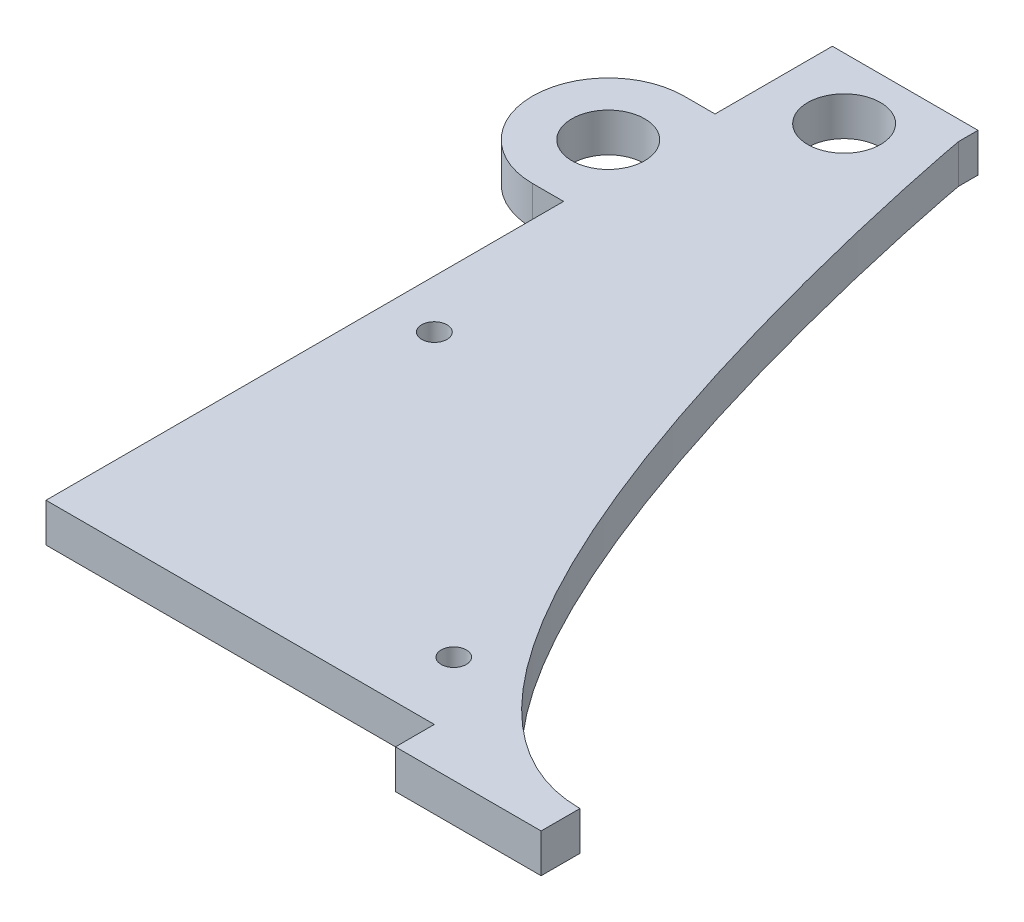
ISO-10303-21;
HEADER;
FILE_DESCRIPTION(('STEP AP214'),'2;1');
FILE_NAME('part.step','',(''),(''),'','','');
FILE_SCHEMA(('AUTOMOTIVE_DESIGN { 1 0 10303 214 1 1 1 1 }'));
ENDSEC;
DATA;
#1=APPLICATION_CONTEXT('core data for automotive mechanical design processes');
#2=APPLICATION_PROTOCOL_DEFINITION('international standard','automotive_design',2000,#1);
#3=PRODUCT_CONTEXT('',#1,'mechanical');
#4=PRODUCT('Part','Part','',(#3));
#5=PRODUCT_RELATED_PRODUCT_CATEGORY('part','',(#4));
#6=PRODUCT_DEFINITION_FORMATION('','',#4);
#7=PRODUCT_DEFINITION_CONTEXT('part definition',#1,'design');
#8=PRODUCT_DEFINITION('design','',#6,#7);
#9=PRODUCT_DEFINITION_SHAPE('','',#8);
#10=(LENGTH_UNIT() NAMED_UNIT(*) SI_UNIT(.MILLI.,.METRE.));
#11=(NAMED_UNIT(*) PLANE_ANGLE_UNIT() SI_UNIT($,.RADIAN.));
#12=(NAMED_UNIT(*) SI_UNIT($,.STERADIAN.) SOLID_ANGLE_UNIT());
#13=UNCERTAINTY_MEASURE_WITH_UNIT(LENGTH_MEASURE(1.E-05),#10,'distance_accuracy_value','');
#14=(GEOMETRIC_REPRESENTATION_CONTEXT(3) GLOBAL_UNCERTAINTY_ASSIGNED_CONTEXT((#13)) GLOBAL_UNIT_ASSIGNED_CONTEXT((#10,
#11,#12)) REPRESENTATION_CONTEXT('',''));
#15=CARTESIAN_POINT('',(0.,0.,0.));
#16=DIRECTION('',(0.,0.,1.));
#17=DIRECTION('',(1.,0.,0.));
#18=AXIS2_PLACEMENT_3D('',#15,#16,#17);
#19=CARTESIAN_POINT('',(-9.525,5.08,48.8950000000001));
#20=DIRECTION('',(1.,0.,0.));
#21=DIRECTION('',(0.,0.,-1.));
#22=AXIS2_PLACEMENT_3D('',#19,#20,#21);
#23=PLANE('',#22);
#24=DIRECTION('',(0.,0.,1.));
#25=VECTOR('',#24,1.);
#26=CARTESIAN_POINT('',(-9.525,5.08,48.8950000000001));
#27=LINE('',#26,#25);
#28=CARTESIAN_POINT('',(-9.52499999999999,5.08,-18.8143243895907));
#29=VERTEX_POINT('',#28);
#30=CARTESIAN_POINT('',(-9.525,5.08,48.8950000000001));
#31=VERTEX_POINT('',#30);
#32=EDGE_CURVE('E58',#29,#31,#27,.T.);
#33=ORIENTED_EDGE('',*,*,#32,.F.);
#34=DIRECTION('',(0.,-1.,0.));
#35=VECTOR('',#34,1.);
#36=CARTESIAN_POINT('',(-9.52499999999999,5.08,-18.8143243895907));
#37=LINE('',#36,#35);
#38=CARTESIAN_POINT('',(-9.52499999999999,0.,-18.8143243895907));
#39=VERTEX_POINT('',#38);
#40=EDGE_CURVE('E179',#29,#39,#37,.T.);
#41=ORIENTED_EDGE('',*,*,#40,.T.);
#42=DIRECTION('',(0.,0.,1.));
#43=VECTOR('',#42,1.);
#44=CARTESIAN_POINT('',(-9.525,0.,48.8950000000001));
#45=LINE('',#44,#43);
#46=CARTESIAN_POINT('',(-9.525,0.,48.8950000000001));
#47=VERTEX_POINT('',#46);
#48=EDGE_CURVE('E350',#39,#47,#45,.T.);
#49=ORIENTED_EDGE('',*,*,#48,.T.);
#50=DIRECTION('',(0.,-1.,0.));
#51=VECTOR('',#50,1.);
#52=CARTESIAN_POINT('',(-9.525,5.08,48.8950000000001));
#53=LINE('',#52,#51);
#54=EDGE_CURVE('E385',#31,#47,#53,.T.);
#55=ORIENTED_EDGE('',*,*,#54,.F.);
#56=EDGE_LOOP('',(#33,#41,#49,#55));
#57=FACE_BOUND('',#56,.T.);
#58=ADVANCED_FACE('F42',(#57),#23,.F.);
#59=CARTESIAN_POINT('',(22.7352910938507,5.08,-1.18732961513015));
#60=DIRECTION('',(0.,-1.,0.));
#61=DIRECTION('',(0.,0.,-1.));
#62=AXIS2_PLACEMENT_3D('',#59,#60,#61);
#63=PLANE('',#62);
#64=DIRECTION('',(-1.,0.,0.));
#65=VECTOR('',#64,1.);
#66=CARTESIAN_POINT('',(-13.589,5.08,-18.8143243895907));
#67=LINE('',#66,#65);
#68=CARTESIAN_POINT('',(-13.589,5.08,-18.8143243895907));
#69=VERTEX_POINT('',#68);
#70=EDGE_CURVE('E144',#29,#69,#67,.T.);
#71=ORIENTED_EDGE('',*,*,#70,.F.);
#72=ORIENTED_EDGE('',*,*,#32,.T.);
#73=DIRECTION('',(1.,0.,0.));
#74=VECTOR('',#73,1.);
#75=CARTESIAN_POINT('',(60.325,5.08,48.8950000000001));
#76=LINE('',#75,#74);
#77=CARTESIAN_POINT('',(41.275,5.08,48.8950000000001));
#78=VERTEX_POINT('',#77);
#79=EDGE_CURVE('E251',#31,#78,#76,.T.);
#80=ORIENTED_EDGE('',*,*,#79,.T.);
#81=DIRECTION('',(0.,0.,1.));
#82=VECTOR('',#81,1.);
#83=CARTESIAN_POINT('',(41.275,5.08,48.8950000000001));
#84=LINE('',#83,#82);
#85=CARTESIAN_POINT('',(41.275,5.08,53.9750000000001));
#86=VERTEX_POINT('',#85);
#87=EDGE_CURVE('E205',#78,#86,#84,.T.);
#88=ORIENTED_EDGE('',*,*,#87,.T.);
#89=DIRECTION('',(1.,0.,0.));
#90=VECTOR('',#89,1.);
#91=CARTESIAN_POINT('',(60.325,5.08,53.9750000000001));
#92=LINE('',#91,#90);
#93=CARTESIAN_POINT('',(60.325,5.08,53.9750000000001));
#94=VERTEX_POINT('',#93);
#95=EDGE_CURVE('E200',#86,#94,#92,.T.);
#96=ORIENTED_EDGE('',*,*,#95,.T.);
#97=DIRECTION('',(0.,0.,-1.));
#98=VECTOR('',#97,1.);
#99=CARTESIAN_POINT('',(60.325,5.08,48.8950000000001));
#100=LINE('',#99,#98);
#101=CARTESIAN_POINT('',(60.325,5.08,48.8950000000001));
#102=VERTEX_POINT('',#101);
#103=EDGE_CURVE('E188',#94,#102,#100,.T.);
#104=ORIENTED_EDGE('',*,*,#103,.T.);
#105=CARTESIAN_POINT('',(60.325,5.08,48.895));
#106=CARTESIAN_POINT('',(27.8191095836019,5.08,48.895));
#107=CARTESIAN_POINT('',(9.525,5.08,-51.214545640347));
#108=CARTESIAN_POINT('',(9.525,5.08,-51.435));
#109=B_SPLINE_CURVE_WITH_KNOTS('',3,(#105,#106,#107,#108),.UNSPECIFIED.,.F.,.F.,(4,4),(0.,1.),.UNSPECIFIED.);
#110=CARTESIAN_POINT('',(9.525,5.08,-51.435));
#111=VERTEX_POINT('',#110);
#112=EDGE_CURVE('E255',#102,#111,#109,.T.);
#113=ORIENTED_EDGE('',*,*,#112,.T.);
#114=DIRECTION('',(0.,0.,-1.));
#115=VECTOR('',#114,1.);
#116=CARTESIAN_POINT('',(9.525,5.08,-51.435));
#117=LINE('',#116,#115);
#118=CARTESIAN_POINT('',(9.52499999999999,5.08,-53.9749999999999));
#119=VERTEX_POINT('',#118);
#120=EDGE_CURVE('E241',#111,#119,#117,.T.);
#121=ORIENTED_EDGE('',*,*,#120,.T.);
#122=DIRECTION('',(-1.,0.,0.));
#123=VECTOR('',#122,1.);
#124=CARTESIAN_POINT('',(-9.52499999999998,5.08,-53.9749999999999));
#125=LINE('',#124,#123);
#126=CARTESIAN_POINT('',(-9.52499999999998,5.08,-53.9749999999999));
#127=VERTEX_POINT('',#126);
#128=EDGE_CURVE('E245',#119,#127,#125,.T.);
#129=ORIENTED_EDGE('',*,*,#128,.T.);
#130=CARTESIAN_POINT('',(-9.52499999999999,5.08,-38.6263243895907));
#131=VERTEX_POINT('',#130);
#132=EDGE_CURVE('E153',#127,#131,#27,.T.);
#133=ORIENTED_EDGE('',*,*,#132,.T.);
#134=DIRECTION('',(1.,0.,0.));
#135=VECTOR('',#134,1.);
#136=CARTESIAN_POINT('',(-13.589,5.08,-38.6263243895907));
#137=LINE('',#136,#135);
#138=CARTESIAN_POINT('',(-13.589,5.08,-38.6263243895907));
#139=VERTEX_POINT('',#138);
#140=EDGE_CURVE('E136',#139,#131,#137,.T.);
#141=ORIENTED_EDGE('',*,*,#140,.F.);
#142=CARTESIAN_POINT('',(-13.589,5.08,-28.7203243895907));
#143=DIRECTION('',(0.,-1.,0.));
#144=DIRECTION('',(0.,0.,-1.));
#145=AXIS2_PLACEMENT_3D('',#142,#143,#144);
#146=CIRCLE('',#145,9.906);
#147=EDGE_CURVE('E151',#69,#139,#146,.T.);
#148=ORIENTED_EDGE('',*,*,#147,.F.);
#149=EDGE_LOOP('',(#71,#72,#80,#88,#96,#104,#113,#121,#129,#133,#141,#148));
#150=FACE_BOUND('',#149,.T.);
#151=CARTESIAN_POINT('',(34.925,5.08,40.0050000000001));
#152=DIRECTION('',(0.,-1.,0.));
#153=DIRECTION('',(0.,0.,-1.));
#154=AXIS2_PLACEMENT_3D('',#151,#152,#153);
#155=CIRCLE('',#154,1.651);
#156=CARTESIAN_POINT('',(34.925,5.08,38.3540000000001));
#157=VERTEX_POINT('',#156);
#158=EDGE_CURVE('E184',#157,#157,#155,.T.);
#159=ORIENTED_EDGE('',*,*,#158,.T.);
#160=EDGE_LOOP('',(#159));
#161=FACE_BOUND('',#160,.T.);
#162=CARTESIAN_POINT('',(-3.17499999999998,5.08,4.44500000000005));
#163=DIRECTION('',(0.,-1.,0.));
#164=DIRECTION('',(0.,0.,-1.));
#165=AXIS2_PLACEMENT_3D('',#162,#163,#164);
#166=CIRCLE('',#165,1.66072838208594);
#167=CARTESIAN_POINT('',(-3.17499999999998,5.08,2.78427161791411));
#168=VERTEX_POINT('',#167);
#169=EDGE_CURVE('E178',#168,#168,#166,.T.);
#170=ORIENTED_EDGE('',*,*,#169,.T.);
#171=EDGE_LOOP('',(#170));
#172=FACE_BOUND('',#171,.T.);
#173=CARTESIAN_POINT('',(-13.589,5.08,-28.7203243895907));
#174=DIRECTION('',(0.,-1.,0.));
#175=DIRECTION('',(0.,0.,-1.));
#176=AXIS2_PLACEMENT_3D('',#173,#174,#175);
#177=CIRCLE('',#176,4.7625);
#178=CARTESIAN_POINT('',(-13.589,5.08,-33.4828243895907));
#179=VERTEX_POINT('',#178);
#180=EDGE_CURVE('E173',#179,#179,#177,.T.);
#181=ORIENTED_EDGE('',*,*,#180,.T.);
#182=EDGE_LOOP('',(#181));
#183=FACE_BOUND('',#182,.T.);
#184=CARTESIAN_POINT('',(0.,5.08,-45.9866999999999));
#185=DIRECTION('',(0.,1.,0.));
#186=DIRECTION('',(0.,0.,1.));
#187=AXIS2_PLACEMENT_3D('',#184,#185,#186);
#188=CIRCLE('',#187,4.7625);
#189=CARTESIAN_POINT('',(0.,5.08,-41.2241999999999));
#190=VERTEX_POINT('',#189);
#191=EDGE_CURVE('E233',#190,#190,#188,.T.);
#192=ORIENTED_EDGE('',*,*,#191,.F.);
#193=EDGE_LOOP('',(#192));
#194=FACE_BOUND('',#193,.T.);
#195=ADVANCED_FACE('F149',(#150,#161,#172,#183,#194),#63,.F.);
#196=CARTESIAN_POINT('',(22.7352910938507,0.,-1.18732961513015));
#197=DIRECTION('',(0.,-1.,0.));
#198=DIRECTION('',(0.,0.,-1.));
#199=AXIS2_PLACEMENT_3D('',#196,#197,#198);
#200=PLANE('',#199);
#201=CARTESIAN_POINT('',(-13.589,0.,-28.7203243895907));
#202=DIRECTION('',(0.,-1.,0.));
#203=DIRECTION('',(0.,0.,-1.));
#204=AXIS2_PLACEMENT_3D('',#201,#202,#203);
#205=CIRCLE('',#204,4.7625);
#206=CARTESIAN_POINT('',(-13.589,0.,-33.4828243895907));
#207=VERTEX_POINT('',#206);
#208=EDGE_CURVE('E165',#207,#207,#205,.T.);
#209=ORIENTED_EDGE('',*,*,#208,.F.);
#210=EDGE_LOOP('',(#209));
#211=FACE_BOUND('',#210,.T.);
#212=ORIENTED_EDGE('',*,*,#48,.F.);
#213=DIRECTION('',(-1.,0.,0.));
#214=VECTOR('',#213,1.);
#215=CARTESIAN_POINT('',(-13.589,0.,-18.8143243895907));
#216=LINE('',#215,#214);
#217=CARTESIAN_POINT('',(-13.589,0.,-18.8143243895907));
#218=VERTEX_POINT('',#217);
#219=EDGE_CURVE('E159',#39,#218,#216,.T.);
#220=ORIENTED_EDGE('',*,*,#219,.T.);
#221=CARTESIAN_POINT('',(-13.589,0.,-28.7203243895907));
#222=DIRECTION('',(0.,-1.,0.));
#223=DIRECTION('',(0.,0.,-1.));
#224=AXIS2_PLACEMENT_3D('',#221,#222,#223);
#225=CIRCLE('',#224,9.906);
#226=CARTESIAN_POINT('',(-13.589,0.,-38.6263243895907));
#227=VERTEX_POINT('',#226);
#228=EDGE_CURVE('E170',#218,#227,#225,.T.);
#229=ORIENTED_EDGE('',*,*,#228,.T.);
#230=DIRECTION('',(1.,0.,0.));
#231=VECTOR('',#230,1.);
#232=CARTESIAN_POINT('',(-13.589,0.,-38.6263243895907));
#233=LINE('',#232,#231);
#234=CARTESIAN_POINT('',(-9.52499999999999,0.,-38.6263243895907));
#235=VERTEX_POINT('',#234);
#236=EDGE_CURVE('E138',#227,#235,#233,.T.);
#237=ORIENTED_EDGE('',*,*,#236,.T.);
#238=CARTESIAN_POINT('',(-9.52499999999998,0.,-53.9749999999999));
#239=VERTEX_POINT('',#238);
#240=EDGE_CURVE('E361',#239,#235,#45,.T.);
#241=ORIENTED_EDGE('',*,*,#240,.F.);
#242=DIRECTION('',(-1.,0.,0.));
#243=VECTOR('',#242,1.);
#244=CARTESIAN_POINT('',(-9.52499999999998,0.,-53.9749999999999));
#245=LINE('',#244,#243);
#246=CARTESIAN_POINT('',(9.52499999999999,0.,-53.9749999999999));
#247=VERTEX_POINT('',#246);
#248=EDGE_CURVE('E362',#247,#239,#245,.T.);
#249=ORIENTED_EDGE('',*,*,#248,.F.);
#250=DIRECTION('',(0.,0.,-1.));
#251=VECTOR('',#250,1.);
#252=CARTESIAN_POINT('',(9.525,0.,-51.435));
#253=LINE('',#252,#251);
#254=CARTESIAN_POINT('',(9.525,0.,-51.435));
#255=VERTEX_POINT('',#254);
#256=EDGE_CURVE('E237',#255,#247,#253,.T.);
#257=ORIENTED_EDGE('',*,*,#256,.F.);
#258=CARTESIAN_POINT('',(60.325,0.,48.895));
#259=CARTESIAN_POINT('',(27.8191095836019,0.,48.895));
#260=CARTESIAN_POINT('',(9.525,0.,-51.214545640347));
#261=CARTESIAN_POINT('',(9.525,0.,-51.435));
#262=B_SPLINE_CURVE_WITH_KNOTS('',3,(#258,#259,#260,#261),.UNSPECIFIED.,.F.,.F.,(4,4),(0.,1.),.UNSPECIFIED.);
#263=CARTESIAN_POINT('',(60.325,0.,48.8950000000001));
#264=VERTEX_POINT('',#263);
#265=EDGE_CURVE('E246',#264,#255,#262,.T.);
#266=ORIENTED_EDGE('',*,*,#265,.F.);
#267=DIRECTION('',(0.,0.,-1.));
#268=VECTOR('',#267,1.);
#269=CARTESIAN_POINT('',(60.325,0.,48.8950000000001));
#270=LINE('',#269,#268);
#271=CARTESIAN_POINT('',(60.325,0.,53.9750000000001));
#272=VERTEX_POINT('',#271);
#273=EDGE_CURVE('E212',#272,#264,#270,.T.);
#274=ORIENTED_EDGE('',*,*,#273,.F.);
#275=DIRECTION('',(1.,0.,0.));
#276=VECTOR('',#275,1.);
#277=CARTESIAN_POINT('',(60.325,0.,53.9750000000001));
#278=LINE('',#277,#276);
#279=CARTESIAN_POINT('',(41.275,0.,53.9750000000001));
#280=VERTEX_POINT('',#279);
#281=EDGE_CURVE('E217',#280,#272,#278,.T.);
#282=ORIENTED_EDGE('',*,*,#281,.F.);
#283=DIRECTION('',(0.,0.,1.));
#284=VECTOR('',#283,1.);
#285=CARTESIAN_POINT('',(41.275,0.,48.8950000000001));
#286=LINE('',#285,#284);
#287=CARTESIAN_POINT('',(41.275,0.,48.8950000000001));
#288=VERTEX_POINT('',#287);
#289=EDGE_CURVE('E222',#288,#280,#286,.T.);
#290=ORIENTED_EDGE('',*,*,#289,.F.);
#291=DIRECTION('',(1.,0.,0.));
#292=VECTOR('',#291,1.);
#293=CARTESIAN_POINT('',(60.325,0.,48.8950000000001));
#294=LINE('',#293,#292);
#295=EDGE_CURVE('E358',#47,#288,#294,.T.);
#296=ORIENTED_EDGE('',*,*,#295,.F.);
#297=EDGE_LOOP('',(#212,#220,#229,#237,#241,#249,#257,#266,#274,#282,#290,#296));
#298=FACE_BOUND('',#297,.T.);
#299=CARTESIAN_POINT('',(34.925,0.,40.0050000000001));
#300=DIRECTION('',(0.,-1.,0.));
#301=DIRECTION('',(0.,0.,-1.));
#302=AXIS2_PLACEMENT_3D('',#299,#300,#301);
#303=CIRCLE('',#302,1.651);
#304=CARTESIAN_POINT('',(34.925,0.,38.3540000000001));
#305=VERTEX_POINT('',#304);
#306=EDGE_CURVE('E189',#305,#305,#303,.T.);
#307=ORIENTED_EDGE('',*,*,#306,.F.);
#308=EDGE_LOOP('',(#307));
#309=FACE_BOUND('',#308,.T.);
#310=CARTESIAN_POINT('',(-3.17499999999998,0.,4.44500000000005));
#311=DIRECTION('',(0.,-1.,0.));
#312=DIRECTION('',(0.,0.,-1.));
#313=AXIS2_PLACEMENT_3D('',#310,#311,#312);
#314=CIRCLE('',#313,1.66072838208594);
#315=CARTESIAN_POINT('',(-3.17499999999998,0.,2.78427161791411));
#316=VERTEX_POINT('',#315);
#317=EDGE_CURVE('E193',#316,#316,#314,.T.);
#318=ORIENTED_EDGE('',*,*,#317,.F.);
#319=EDGE_LOOP('',(#318));
#320=FACE_BOUND('',#319,.T.);
#321=CARTESIAN_POINT('',(0.,0.,-45.9866999999999));
#322=DIRECTION('',(0.,1.,0.));
#323=DIRECTION('',(0.,0.,1.));
#324=AXIS2_PLACEMENT_3D('',#321,#322,#323);
#325=CIRCLE('',#324,4.7625);
#326=CARTESIAN_POINT('',(0.,0.,-41.2241999999999));
#327=VERTEX_POINT('',#326);
#328=EDGE_CURVE('E215',#327,#327,#325,.T.);
#329=ORIENTED_EDGE('',*,*,#328,.T.);
#330=EDGE_LOOP('',(#329));
#331=FACE_BOUND('',#330,.T.);
#332=ADVANCED_FACE('F274',(#211,#298,#309,#320,#331),#200,.T.);
#333=CARTESIAN_POINT('',(9.525,5.08,-51.435));
#334=DIRECTION('',(-1.,0.,0.));
#335=DIRECTION('',(0.,0.,1.));
#336=AXIS2_PLACEMENT_3D('',#333,#334,#335);
#337=PLANE('',#336);
#338=ORIENTED_EDGE('',*,*,#256,.T.);
#339=DIRECTION('',(0.,-1.,0.));
#340=VECTOR('',#339,1.);
#341=CARTESIAN_POINT('',(9.52499999999999,5.08,-53.9749999999999));
#342=LINE('',#341,#340);
#343=EDGE_CURVE('E11',#119,#247,#342,.T.);
#344=ORIENTED_EDGE('',*,*,#343,.F.);
#345=ORIENTED_EDGE('',*,*,#120,.F.);
#346=DIRECTION('',(0.,-1.,0.));
#347=VECTOR('',#346,1.);
#348=CARTESIAN_POINT('',(9.525,5.08,-51.435));
#349=LINE('',#348,#347);
#350=EDGE_CURVE('E261',#111,#255,#349,.T.);
#351=ORIENTED_EDGE('',*,*,#350,.T.);
#352=EDGE_LOOP('',(#338,#344,#345,#351));
#353=FACE_BOUND('',#352,.T.);
#354=ADVANCED_FACE('F44',(#353),#337,.F.);
#355=CARTESIAN_POINT('',(-9.52499999999998,5.08,-53.9749999999999));
#356=DIRECTION('',(0.,0.,1.));
#357=DIRECTION('',(1.,0.,0.));
#358=AXIS2_PLACEMENT_3D('',#355,#356,#357);
#359=PLANE('',#358);
#360=ORIENTED_EDGE('',*,*,#248,.T.);
#361=DIRECTION('',(0.,-1.,0.));
#362=VECTOR('',#361,1.);
#363=CARTESIAN_POINT('',(-9.52499999999998,5.08,-53.9749999999999));
#364=LINE('',#363,#362);
#365=EDGE_CURVE('E51',#127,#239,#364,.T.);
#366=ORIENTED_EDGE('',*,*,#365,.F.);
#367=ORIENTED_EDGE('',*,*,#128,.F.);
#368=ORIENTED_EDGE('',*,*,#343,.T.);
#369=EDGE_LOOP('',(#360,#366,#367,#368));
#370=FACE_BOUND('',#369,.T.);
#371=ADVANCED_FACE('F281',(#370),#359,.F.);
#372=ORIENTED_EDGE('',*,*,#240,.T.);
#373=DIRECTION('',(0.,-1.,0.));
#374=VECTOR('',#373,1.);
#375=CARTESIAN_POINT('',(-9.52499999999999,5.08,-38.6263243895907));
#376=LINE('',#375,#374);
#377=EDGE_CURVE('E66',#131,#235,#376,.T.);
#378=ORIENTED_EDGE('',*,*,#377,.F.);
#379=ORIENTED_EDGE('',*,*,#132,.F.);
#380=ORIENTED_EDGE('',*,*,#365,.T.);
#381=EDGE_LOOP('',(#372,#378,#379,#380));
#382=FACE_BOUND('',#381,.T.);
#383=ADVANCED_FACE('F278',(#382),#23,.F.);
#384=CARTESIAN_POINT('',(60.325,5.08,48.8950000000001));
#385=DIRECTION('',(0.,0.,-1.));
#386=DIRECTION('',(-1.,0.,0.));
#387=AXIS2_PLACEMENT_3D('',#384,#385,#386);
#388=PLANE('',#387);
#389=ORIENTED_EDGE('',*,*,#295,.T.);
#390=DIRECTION('',(0.,1.,0.));
#391=VECTOR('',#390,1.);
#392=CARTESIAN_POINT('',(41.275,-19.7157018642502,48.8950000000001));
#393=LINE('',#392,#391);
#394=EDGE_CURVE('E204',#288,#78,#393,.T.);
#395=ORIENTED_EDGE('',*,*,#394,.T.);
#396=ORIENTED_EDGE('',*,*,#79,.F.);
#397=ORIENTED_EDGE('',*,*,#54,.T.);
#398=EDGE_LOOP('',(#389,#395,#396,#397));
#399=FACE_BOUND('',#398,.T.);
#400=ADVANCED_FACE('F272',(#399),#388,.F.);
#401=DIRECTION('',(0.,-1.,0.));
#402=VECTOR('',#401,1.);
#403=SURFACE_OF_LINEAR_EXTRUSION('',#109,#402);
#404=ORIENTED_EDGE('',*,*,#265,.T.);
#405=ORIENTED_EDGE('',*,*,#350,.F.);
#406=ORIENTED_EDGE('',*,*,#112,.F.);
#407=DIRECTION('',(0.,-1.,0.));
#408=VECTOR('',#407,1.);
#409=CARTESIAN_POINT('',(60.325,5.08,48.8950000000001));
#410=LINE('',#409,#408);
#411=EDGE_CURVE('E381',#102,#264,#410,.T.);
#412=ORIENTED_EDGE('',*,*,#411,.T.);
#413=EDGE_LOOP('',(#404,#405,#406,#412));
#414=FACE_BOUND('',#413,.T.);
#415=ADVANCED_FACE('F267',(#414),#403,.F.);
#416=CARTESIAN_POINT('',(0.,5.08,-45.9866999999999));
#417=DIRECTION('',(0.,-1.,0.));
#418=DIRECTION('',(0.,0.,-1.));
#419=AXIS2_PLACEMENT_3D('',#416,#417,#418);
#420=CYLINDRICAL_SURFACE('',#419,4.7625);
#421=ORIENTED_EDGE('',*,*,#191,.T.);
#422=EDGE_LOOP('',(#421));
#423=FACE_BOUND('',#422,.T.);
#424=ORIENTED_EDGE('',*,*,#328,.F.);
#425=EDGE_LOOP('',(#424));
#426=FACE_BOUND('',#425,.T.);
#427=ADVANCED_FACE('F271',(#423,#426),#420,.F.);
#428=CARTESIAN_POINT('',(41.275,-19.7157018642502,48.8950000000001));
#429=DIRECTION('',(-1.,0.,0.));
#430=DIRECTION('',(0.,0.,1.));
#431=AXIS2_PLACEMENT_3D('',#428,#429,#430);
#432=PLANE('',#431);
#433=ORIENTED_EDGE('',*,*,#394,.F.);
#434=ORIENTED_EDGE('',*,*,#289,.T.);
#435=DIRECTION('',(0.,1.,0.));
#436=VECTOR('',#435,1.);
#437=CARTESIAN_POINT('',(41.275,-19.7157018642502,53.9750000000001));
#438=LINE('',#437,#436);
#439=EDGE_CURVE('E221',#280,#86,#438,.T.);
#440=ORIENTED_EDGE('',*,*,#439,.T.);
#441=ORIENTED_EDGE('',*,*,#87,.F.);
#442=EDGE_LOOP('',(#433,#434,#440,#441));
#443=FACE_BOUND('',#442,.T.);
#444=ADVANCED_FACE('F299',(#443),#432,.T.);
#445=CARTESIAN_POINT('',(60.325,-19.7157018642502,53.9750000000001));
#446=DIRECTION('',(0.,0.,1.));
#447=DIRECTION('',(1.,0.,0.));
#448=AXIS2_PLACEMENT_3D('',#445,#446,#447);
#449=PLANE('',#448);
#450=ORIENTED_EDGE('',*,*,#439,.F.);
#451=ORIENTED_EDGE('',*,*,#281,.T.);
#452=DIRECTION('',(0.,1.,0.));
#453=VECTOR('',#452,1.);
#454=CARTESIAN_POINT('',(60.325,-19.7157018642502,53.9750000000001));
#455=LINE('',#454,#453);
#456=EDGE_CURVE('E216',#272,#94,#455,.T.);
#457=ORIENTED_EDGE('',*,*,#456,.T.);
#458=ORIENTED_EDGE('',*,*,#95,.F.);
#459=EDGE_LOOP('',(#450,#451,#457,#458));
#460=FACE_BOUND('',#459,.T.);
#461=ADVANCED_FACE('F303',(#460),#449,.T.);
#462=CARTESIAN_POINT('',(60.325,-19.7157018642502,48.8950000000001));
#463=DIRECTION('',(1.,0.,0.));
#464=DIRECTION('',(0.,0.,-1.));
#465=AXIS2_PLACEMENT_3D('',#462,#463,#464);
#466=PLANE('',#465);
#467=ORIENTED_EDGE('',*,*,#456,.F.);
#468=ORIENTED_EDGE('',*,*,#273,.T.);
#469=ORIENTED_EDGE('',*,*,#411,.F.);
#470=ORIENTED_EDGE('',*,*,#103,.F.);
#471=EDGE_LOOP('',(#467,#468,#469,#470));
#472=FACE_BOUND('',#471,.T.);
#473=ADVANCED_FACE('F307',(#472),#466,.T.);
#474=CARTESIAN_POINT('',(-3.17499999999998,5.08,4.44500000000005));
#475=DIRECTION('',(0.,-1.,0.));
#476=DIRECTION('',(0.,0.,-1.));
#477=AXIS2_PLACEMENT_3D('',#474,#475,#476);
#478=CYLINDRICAL_SURFACE('',#477,1.66072838208594);
#479=ORIENTED_EDGE('',*,*,#169,.F.);
#480=EDGE_LOOP('',(#479));
#481=FACE_BOUND('',#480,.T.);
#482=ORIENTED_EDGE('',*,*,#317,.T.);
#483=EDGE_LOOP('',(#482));
#484=FACE_BOUND('',#483,.T.);
#485=ADVANCED_FACE('F311',(#481,#484),#478,.F.);
#486=CARTESIAN_POINT('',(34.925,5.08,40.0050000000001));
#487=DIRECTION('',(0.,-1.,0.));
#488=DIRECTION('',(0.,0.,-1.));
#489=AXIS2_PLACEMENT_3D('',#486,#487,#488);
#490=CYLINDRICAL_SURFACE('',#489,1.651);
#491=ORIENTED_EDGE('',*,*,#158,.F.);
#492=EDGE_LOOP('',(#491));
#493=FACE_BOUND('',#492,.T.);
#494=ORIENTED_EDGE('',*,*,#306,.T.);
#495=EDGE_LOOP('',(#494));
#496=FACE_BOUND('',#495,.T.);
#497=ADVANCED_FACE('F315',(#493,#496),#490,.F.);
#498=CARTESIAN_POINT('',(-13.589,5.08,-28.7203243895907));
#499=DIRECTION('',(0.,-1.,0.));
#500=DIRECTION('',(0.,0.,-1.));
#501=AXIS2_PLACEMENT_3D('',#498,#499,#500);
#502=CYLINDRICAL_SURFACE('',#501,4.7625);
#503=ORIENTED_EDGE('',*,*,#180,.F.);
#504=EDGE_LOOP('',(#503));
#505=FACE_BOUND('',#504,.T.);
#506=ORIENTED_EDGE('',*,*,#208,.T.);
#507=EDGE_LOOP('',(#506));
#508=FACE_BOUND('',#507,.T.);
#509=ADVANCED_FACE('F319',(#505,#508),#502,.F.);
#510=CARTESIAN_POINT('',(-13.589,5.08,-28.7203243895907));
#511=DIRECTION('',(0.,-1.,0.));
#512=DIRECTION('',(0.,0.,-1.));
#513=AXIS2_PLACEMENT_3D('',#510,#511,#512);
#514=CYLINDRICAL_SURFACE('',#513,9.906);
#515=ORIENTED_EDGE('',*,*,#228,.F.);
#516=DIRECTION('',(0.,-1.,0.));
#517=VECTOR('',#516,1.);
#518=CARTESIAN_POINT('',(-13.589,5.08,-18.8143243895907));
#519=LINE('',#518,#517);
#520=EDGE_CURVE('E157',#69,#218,#519,.T.);
#521=ORIENTED_EDGE('',*,*,#520,.F.);
#522=ORIENTED_EDGE('',*,*,#147,.T.);
#523=DIRECTION('',(0.,-1.,0.));
#524=VECTOR('',#523,1.);
#525=CARTESIAN_POINT('',(-13.589,5.08,-38.6263243895907));
#526=LINE('',#525,#524);
#527=EDGE_CURVE('E133',#139,#227,#526,.T.);
#528=ORIENTED_EDGE('',*,*,#527,.T.);
#529=EDGE_LOOP('',(#515,#521,#522,#528));
#530=FACE_BOUND('',#529,.T.);
#531=ADVANCED_FACE('F156',(#530),#514,.T.);
#532=CARTESIAN_POINT('',(-13.589,5.08,-18.8143243895907));
#533=DIRECTION('',(0.,0.,1.));
#534=DIRECTION('',(1.,0.,0.));
#535=AXIS2_PLACEMENT_3D('',#532,#533,#534);
#536=PLANE('',#535);
#537=ORIENTED_EDGE('',*,*,#219,.F.);
#538=ORIENTED_EDGE('',*,*,#40,.F.);
#539=ORIENTED_EDGE('',*,*,#70,.T.);
#540=ORIENTED_EDGE('',*,*,#520,.T.);
#541=EDGE_LOOP('',(#537,#538,#539,#540));
#542=FACE_BOUND('',#541,.T.);
#543=ADVANCED_FACE('F323',(#542),#536,.T.);
#544=CARTESIAN_POINT('',(-13.589,5.08,-38.6263243895907));
#545=DIRECTION('',(0.,0.,-1.));
#546=DIRECTION('',(-1.,0.,0.));
#547=AXIS2_PLACEMENT_3D('',#544,#545,#546);
#548=PLANE('',#547);
#549=ORIENTED_EDGE('',*,*,#236,.F.);
#550=ORIENTED_EDGE('',*,*,#527,.F.);
#551=ORIENTED_EDGE('',*,*,#140,.T.);
#552=ORIENTED_EDGE('',*,*,#377,.T.);
#553=EDGE_LOOP('',(#549,#550,#551,#552));
#554=FACE_BOUND('',#553,.T.);
#555=ADVANCED_FACE('F135',(#554),#548,.T.);
#556=CLOSED_SHELL('',(#58,#195,#332,#354,#371,#383,#400,#415,#427,#444,#461,#473,#485,#497,#509,
#531,#543,#555));
#557=MANIFOLD_SOLID_BREP('B2',#556);
#558=ADVANCED_BREP_SHAPE_REPRESENTATION('',(#18,#557),#14);
#559=SHAPE_DEFINITION_REPRESENTATION(#9,#558);
ENDSEC;
END-ISO-10303-21;
